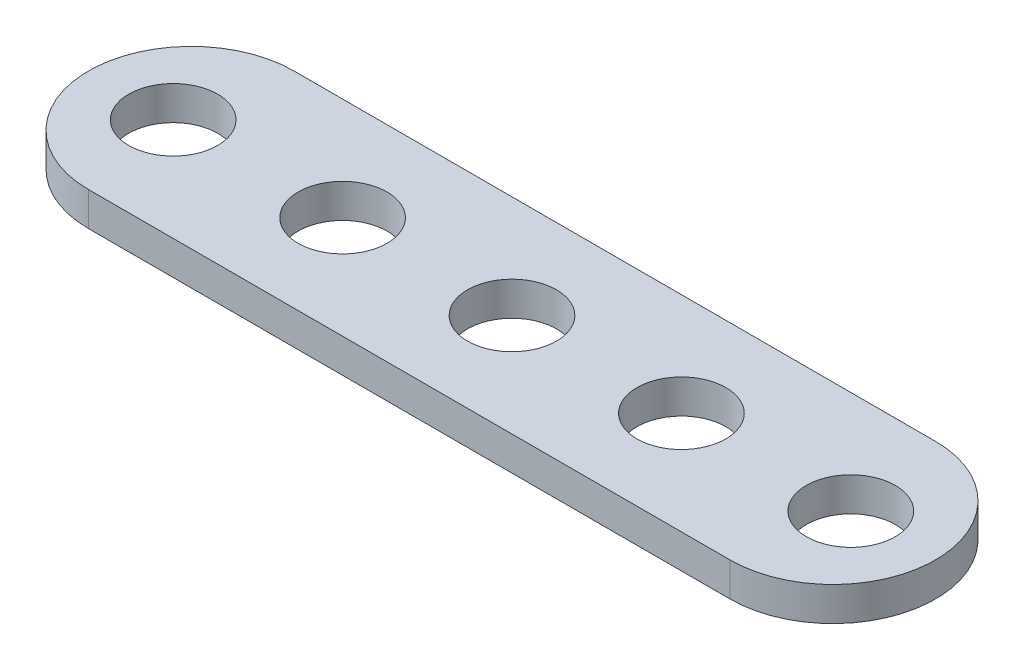
ISO-10303-21;
HEADER;
FILE_DESCRIPTION(('STEP AP214'),'2;1');
FILE_NAME('part.step','',(''),(''),'','','');
FILE_SCHEMA(('AUTOMOTIVE_DESIGN { 1 0 10303 214 1 1 1 1 }'));
ENDSEC;
DATA;
#1=APPLICATION_CONTEXT('core data for automotive mechanical design processes');
#2=APPLICATION_PROTOCOL_DEFINITION('international standard','automotive_design',2000,#1);
#3=PRODUCT_CONTEXT('',#1,'mechanical');
#4=PRODUCT('Part','Part','',(#3));
#5=PRODUCT_RELATED_PRODUCT_CATEGORY('part','',(#4));
#6=PRODUCT_DEFINITION_FORMATION('','',#4);
#7=PRODUCT_DEFINITION_CONTEXT('part definition',#1,'design');
#8=PRODUCT_DEFINITION('design','',#6,#7);
#9=PRODUCT_DEFINITION_SHAPE('','',#8);
#10=(LENGTH_UNIT() NAMED_UNIT(*) SI_UNIT(.MILLI.,.METRE.));
#11=(NAMED_UNIT(*) PLANE_ANGLE_UNIT() SI_UNIT($,.RADIAN.));
#12=(NAMED_UNIT(*) SI_UNIT($,.STERADIAN.) SOLID_ANGLE_UNIT());
#13=UNCERTAINTY_MEASURE_WITH_UNIT(LENGTH_MEASURE(1.E-05),#10,'distance_accuracy_value','');
#14=(GEOMETRIC_REPRESENTATION_CONTEXT(3) GLOBAL_UNCERTAINTY_ASSIGNED_CONTEXT((#13)) GLOBAL_UNIT_ASSIGNED_CONTEXT((#10,
#11,#12)) REPRESENTATION_CONTEXT('',''));
#15=CARTESIAN_POINT('',(0.,0.,0.));
#16=DIRECTION('',(0.,0.,1.));
#17=DIRECTION('',(1.,0.,0.));
#18=AXIS2_PLACEMENT_3D('',#15,#16,#17);
#19=CARTESIAN_POINT('',(4.85,1.6,0.));
#20=DIRECTION('',(0.,-1.,0.));
#21=DIRECTION('',(0.,0.,-1.));
#22=AXIS2_PLACEMENT_3D('',#19,#20,#21);
#23=CYLINDRICAL_SURFACE('',#22,4.85);
#24=CARTESIAN_POINT('',(4.85,0.,0.));
#25=DIRECTION('',(0.,1.,0.));
#26=DIRECTION('',(0.,0.,1.));
#27=AXIS2_PLACEMENT_3D('',#24,#25,#26);
#28=CIRCLE('',#27,4.85);
#29=CARTESIAN_POINT('',(4.85,0.,-4.85));
#30=VERTEX_POINT('',#29);
#31=CARTESIAN_POINT('',(4.85,0.,4.85));
#32=VERTEX_POINT('',#31);
#33=EDGE_CURVE('E95',#30,#32,#28,.T.);
#34=ORIENTED_EDGE('',*,*,#33,.T.);
#35=DIRECTION('',(0.,-1.,0.));
#36=VECTOR('',#35,1.);
#37=CARTESIAN_POINT('',(4.85,1.6,4.85));
#38=LINE('',#37,#36);
#39=CARTESIAN_POINT('',(4.85,1.6,4.85));
#40=VERTEX_POINT('',#39);
#41=EDGE_CURVE('E11',#40,#32,#38,.T.);
#42=ORIENTED_EDGE('',*,*,#41,.F.);
#43=CARTESIAN_POINT('',(4.85,1.6,0.));
#44=DIRECTION('',(0.,1.,0.));
#45=DIRECTION('',(0.,0.,1.));
#46=AXIS2_PLACEMENT_3D('',#43,#44,#45);
#47=CIRCLE('',#46,4.85);
#48=CARTESIAN_POINT('',(4.85,1.6,-4.85));
#49=VERTEX_POINT('',#48);
#50=EDGE_CURVE('E83',#49,#40,#47,.T.);
#51=ORIENTED_EDGE('',*,*,#50,.F.);
#52=DIRECTION('',(0.,-1.,0.));
#53=VECTOR('',#52,1.);
#54=CARTESIAN_POINT('',(4.85,1.6,-4.85));
#55=LINE('',#54,#53);
#56=EDGE_CURVE('E91',#49,#30,#55,.T.);
#57=ORIENTED_EDGE('',*,*,#56,.T.);
#58=EDGE_LOOP('',(#34,#42,#51,#57));
#59=FACE_BOUND('',#58,.T.);
#60=ADVANCED_FACE('F32',(#59),#23,.T.);
#61=CARTESIAN_POINT('',(4.85,1.6,4.85));
#62=DIRECTION('',(0.,0.,-1.));
#63=DIRECTION('',(-1.,0.,0.));
#64=AXIS2_PLACEMENT_3D('',#61,#62,#63);
#65=PLANE('',#64);
#66=DIRECTION('',(1.,0.,0.));
#67=VECTOR('',#66,1.);
#68=CARTESIAN_POINT('',(4.85,0.,4.85));
#69=LINE('',#68,#67);
#70=CARTESIAN_POINT('',(35.15,0.,4.85));
#71=VERTEX_POINT('',#70);
#72=EDGE_CURVE('E87',#32,#71,#69,.T.);
#73=ORIENTED_EDGE('',*,*,#72,.T.);
#74=DIRECTION('',(0.,-1.,0.));
#75=VECTOR('',#74,1.);
#76=CARTESIAN_POINT('',(35.15,1.6,4.85));
#77=LINE('',#76,#75);
#78=CARTESIAN_POINT('',(35.15,1.6,4.85));
#79=VERTEX_POINT('',#78);
#80=EDGE_CURVE('E40',#79,#71,#77,.T.);
#81=ORIENTED_EDGE('',*,*,#80,.F.);
#82=DIRECTION('',(1.,0.,0.));
#83=VECTOR('',#82,1.);
#84=CARTESIAN_POINT('',(4.85,1.6,4.85));
#85=LINE('',#84,#83);
#86=EDGE_CURVE('E78',#40,#79,#85,.T.);
#87=ORIENTED_EDGE('',*,*,#86,.F.);
#88=ORIENTED_EDGE('',*,*,#41,.T.);
#89=EDGE_LOOP('',(#73,#81,#87,#88));
#90=FACE_BOUND('',#89,.T.);
#91=ADVANCED_FACE('F86',(#90),#65,.F.);
#92=CARTESIAN_POINT('',(35.15,1.6,0.));
#93=DIRECTION('',(0.,-1.,0.));
#94=DIRECTION('',(0.,0.,-1.));
#95=AXIS2_PLACEMENT_3D('',#92,#93,#94);
#96=CYLINDRICAL_SURFACE('',#95,4.85);
#97=CARTESIAN_POINT('',(35.15,0.,0.));
#98=DIRECTION('',(0.,1.,0.));
#99=DIRECTION('',(0.,0.,1.));
#100=AXIS2_PLACEMENT_3D('',#97,#98,#99);
#101=CIRCLE('',#100,4.85);
#102=CARTESIAN_POINT('',(35.15,0.,-4.85));
#103=VERTEX_POINT('',#102);
#104=EDGE_CURVE('E65',#71,#103,#101,.T.);
#105=ORIENTED_EDGE('',*,*,#104,.T.);
#106=DIRECTION('',(0.,-1.,0.));
#107=VECTOR('',#106,1.);
#108=CARTESIAN_POINT('',(35.15,1.6,-4.85));
#109=LINE('',#108,#107);
#110=CARTESIAN_POINT('',(35.15,1.6,-4.85));
#111=VERTEX_POINT('',#110);
#112=EDGE_CURVE('E88',#111,#103,#109,.T.);
#113=ORIENTED_EDGE('',*,*,#112,.F.);
#114=CARTESIAN_POINT('',(35.15,1.6,0.));
#115=DIRECTION('',(0.,1.,0.));
#116=DIRECTION('',(0.,0.,1.));
#117=AXIS2_PLACEMENT_3D('',#114,#115,#116);
#118=CIRCLE('',#117,4.85);
#119=EDGE_CURVE('E81',#79,#111,#118,.T.);
#120=ORIENTED_EDGE('',*,*,#119,.F.);
#121=ORIENTED_EDGE('',*,*,#80,.T.);
#122=EDGE_LOOP('',(#105,#113,#120,#121));
#123=FACE_BOUND('',#122,.T.);
#124=ADVANCED_FACE('F89',(#123),#96,.T.);
#125=CARTESIAN_POINT('',(4.85,1.6,-4.85));
#126=DIRECTION('',(0.,0.,1.));
#127=DIRECTION('',(1.,0.,0.));
#128=AXIS2_PLACEMENT_3D('',#125,#126,#127);
#129=PLANE('',#128);
#130=DIRECTION('',(-1.,0.,0.));
#131=VECTOR('',#130,1.);
#132=CARTESIAN_POINT('',(4.85,0.,-4.85));
#133=LINE('',#132,#131);
#134=EDGE_CURVE('E71',#103,#30,#133,.T.);
#135=ORIENTED_EDGE('',*,*,#134,.T.);
#136=ORIENTED_EDGE('',*,*,#56,.F.);
#137=DIRECTION('',(-1.,0.,0.));
#138=VECTOR('',#137,1.);
#139=CARTESIAN_POINT('',(4.85,1.6,-4.85));
#140=LINE('',#139,#138);
#141=EDGE_CURVE('E48',#111,#49,#140,.T.);
#142=ORIENTED_EDGE('',*,*,#141,.F.);
#143=ORIENTED_EDGE('',*,*,#112,.T.);
#144=EDGE_LOOP('',(#135,#136,#142,#143));
#145=FACE_BOUND('',#144,.T.);
#146=ADVANCED_FACE('F103',(#145),#129,.F.);
#147=CARTESIAN_POINT('',(4.85,1.6,0.));
#148=DIRECTION('',(0.,1.,0.));
#149=DIRECTION('',(0.,0.,1.));
#150=AXIS2_PLACEMENT_3D('',#147,#148,#149);
#151=PLANE('',#150);
#152=CARTESIAN_POINT('',(36.,1.6,0.));
#153=DIRECTION('',(0.,1.,0.));
#154=DIRECTION('',(0.,0.,1.));
#155=AXIS2_PLACEMENT_3D('',#152,#153,#154);
#156=CIRCLE('',#155,2.1);
#157=CARTESIAN_POINT('',(36.,1.6,2.1));
#158=VERTEX_POINT('',#157);
#159=EDGE_CURVE('E133',#158,#158,#156,.T.);
#160=ORIENTED_EDGE('',*,*,#159,.F.);
#161=EDGE_LOOP('',(#160));
#162=FACE_BOUND('',#161,.T.);
#163=CARTESIAN_POINT('',(28.,1.6,0.));
#164=DIRECTION('',(0.,1.,0.));
#165=DIRECTION('',(0.,0.,1.));
#166=AXIS2_PLACEMENT_3D('',#163,#164,#165);
#167=CIRCLE('',#166,2.1);
#168=CARTESIAN_POINT('',(28.,1.6,2.1));
#169=VERTEX_POINT('',#168);
#170=EDGE_CURVE('E127',#169,#169,#167,.T.);
#171=ORIENTED_EDGE('',*,*,#170,.F.);
#172=EDGE_LOOP('',(#171));
#173=FACE_BOUND('',#172,.T.);
#174=CARTESIAN_POINT('',(20.,1.6,0.));
#175=DIRECTION('',(0.,1.,0.));
#176=DIRECTION('',(0.,0.,1.));
#177=AXIS2_PLACEMENT_3D('',#174,#175,#176);
#178=CIRCLE('',#177,2.1);
#179=CARTESIAN_POINT('',(20.,1.6,2.1));
#180=VERTEX_POINT('',#179);
#181=EDGE_CURVE('E121',#180,#180,#178,.T.);
#182=ORIENTED_EDGE('',*,*,#181,.F.);
#183=EDGE_LOOP('',(#182));
#184=FACE_BOUND('',#183,.T.);
#185=CARTESIAN_POINT('',(12.,1.6,0.));
#186=DIRECTION('',(0.,1.,0.));
#187=DIRECTION('',(0.,0.,1.));
#188=AXIS2_PLACEMENT_3D('',#185,#186,#187);
#189=CIRCLE('',#188,2.1);
#190=CARTESIAN_POINT('',(12.,1.6,2.1));
#191=VERTEX_POINT('',#190);
#192=EDGE_CURVE('E115',#191,#191,#189,.T.);
#193=ORIENTED_EDGE('',*,*,#192,.F.);
#194=EDGE_LOOP('',(#193));
#195=FACE_BOUND('',#194,.T.);
#196=CARTESIAN_POINT('',(4.,1.6,0.));
#197=DIRECTION('',(0.,1.,0.));
#198=DIRECTION('',(0.,0.,1.));
#199=AXIS2_PLACEMENT_3D('',#196,#197,#198);
#200=CIRCLE('',#199,2.1);
#201=CARTESIAN_POINT('',(4.,1.6,2.1));
#202=VERTEX_POINT('',#201);
#203=EDGE_CURVE('E109',#202,#202,#200,.T.);
#204=ORIENTED_EDGE('',*,*,#203,.F.);
#205=EDGE_LOOP('',(#204));
#206=FACE_BOUND('',#205,.T.);
#207=ORIENTED_EDGE('',*,*,#50,.T.);
#208=ORIENTED_EDGE('',*,*,#86,.T.);
#209=ORIENTED_EDGE('',*,*,#119,.T.);
#210=ORIENTED_EDGE('',*,*,#141,.T.);
#211=EDGE_LOOP('',(#207,#208,#209,#210));
#212=FACE_BOUND('',#211,.T.);
#213=ADVANCED_FACE('F79',(#162,#173,#184,#195,#206,#212),#151,.T.);
#214=CARTESIAN_POINT('',(4.85,0.,0.));
#215=DIRECTION('',(0.,1.,0.));
#216=DIRECTION('',(0.,0.,1.));
#217=AXIS2_PLACEMENT_3D('',#214,#215,#216);
#218=PLANE('',#217);
#219=CARTESIAN_POINT('',(36.,0.,0.));
#220=DIRECTION('',(0.,1.,0.));
#221=DIRECTION('',(0.,0.,1.));
#222=AXIS2_PLACEMENT_3D('',#219,#220,#221);
#223=CIRCLE('',#222,2.1);
#224=CARTESIAN_POINT('',(36.,0.,2.1));
#225=VERTEX_POINT('',#224);
#226=EDGE_CURVE('E130',#225,#225,#223,.T.);
#227=ORIENTED_EDGE('',*,*,#226,.T.);
#228=EDGE_LOOP('',(#227));
#229=FACE_BOUND('',#228,.T.);
#230=CARTESIAN_POINT('',(28.,0.,0.));
#231=DIRECTION('',(0.,1.,0.));
#232=DIRECTION('',(0.,0.,1.));
#233=AXIS2_PLACEMENT_3D('',#230,#231,#232);
#234=CIRCLE('',#233,2.1);
#235=CARTESIAN_POINT('',(28.,0.,2.1));
#236=VERTEX_POINT('',#235);
#237=EDGE_CURVE('E124',#236,#236,#234,.T.);
#238=ORIENTED_EDGE('',*,*,#237,.T.);
#239=EDGE_LOOP('',(#238));
#240=FACE_BOUND('',#239,.T.);
#241=CARTESIAN_POINT('',(20.,0.,0.));
#242=DIRECTION('',(0.,1.,0.));
#243=DIRECTION('',(0.,0.,1.));
#244=AXIS2_PLACEMENT_3D('',#241,#242,#243);
#245=CIRCLE('',#244,2.1);
#246=CARTESIAN_POINT('',(20.,0.,2.1));
#247=VERTEX_POINT('',#246);
#248=EDGE_CURVE('E118',#247,#247,#245,.T.);
#249=ORIENTED_EDGE('',*,*,#248,.T.);
#250=EDGE_LOOP('',(#249));
#251=FACE_BOUND('',#250,.T.);
#252=CARTESIAN_POINT('',(12.,0.,0.));
#253=DIRECTION('',(0.,1.,0.));
#254=DIRECTION('',(0.,0.,1.));
#255=AXIS2_PLACEMENT_3D('',#252,#253,#254);
#256=CIRCLE('',#255,2.1);
#257=CARTESIAN_POINT('',(12.,0.,2.1));
#258=VERTEX_POINT('',#257);
#259=EDGE_CURVE('E112',#258,#258,#256,.T.);
#260=ORIENTED_EDGE('',*,*,#259,.T.);
#261=EDGE_LOOP('',(#260));
#262=FACE_BOUND('',#261,.T.);
#263=CARTESIAN_POINT('',(4.,0.,0.));
#264=DIRECTION('',(0.,1.,0.));
#265=DIRECTION('',(0.,0.,1.));
#266=AXIS2_PLACEMENT_3D('',#263,#264,#265);
#267=CIRCLE('',#266,2.1);
#268=CARTESIAN_POINT('',(4.,0.,2.1));
#269=VERTEX_POINT('',#268);
#270=EDGE_CURVE('E98',#269,#269,#267,.T.);
#271=ORIENTED_EDGE('',*,*,#270,.T.);
#272=EDGE_LOOP('',(#271));
#273=FACE_BOUND('',#272,.T.);
#274=ORIENTED_EDGE('',*,*,#33,.F.);
#275=ORIENTED_EDGE('',*,*,#134,.F.);
#276=ORIENTED_EDGE('',*,*,#104,.F.);
#277=ORIENTED_EDGE('',*,*,#72,.F.);
#278=EDGE_LOOP('',(#274,#275,#276,#277));
#279=FACE_BOUND('',#278,.T.);
#280=ADVANCED_FACE('F106',(#229,#240,#251,#262,#273,#279),#218,.F.);
#281=CARTESIAN_POINT('',(4.,0.,0.));
#282=DIRECTION('',(0.,1.,0.));
#283=DIRECTION('',(0.,0.,1.));
#284=AXIS2_PLACEMENT_3D('',#281,#282,#283);
#285=CYLINDRICAL_SURFACE('',#284,2.1);
#286=ORIENTED_EDGE('',*,*,#270,.F.);
#287=EDGE_LOOP('',(#286));
#288=FACE_BOUND('',#287,.T.);
#289=ORIENTED_EDGE('',*,*,#203,.T.);
#290=EDGE_LOOP('',(#289));
#291=FACE_BOUND('',#290,.T.);
#292=ADVANCED_FACE('F159',(#288,#291),#285,.F.);
#293=CARTESIAN_POINT('',(12.,0.,0.));
#294=DIRECTION('',(0.,1.,0.));
#295=DIRECTION('',(0.,0.,1.));
#296=AXIS2_PLACEMENT_3D('',#293,#294,#295);
#297=CYLINDRICAL_SURFACE('',#296,2.1);
#298=ORIENTED_EDGE('',*,*,#259,.F.);
#299=EDGE_LOOP('',(#298));
#300=FACE_BOUND('',#299,.T.);
#301=ORIENTED_EDGE('',*,*,#192,.T.);
#302=EDGE_LOOP('',(#301));
#303=FACE_BOUND('',#302,.T.);
#304=ADVANCED_FACE('F161',(#300,#303),#297,.F.);
#305=CARTESIAN_POINT('',(20.,0.,0.));
#306=DIRECTION('',(0.,1.,0.));
#307=DIRECTION('',(0.,0.,1.));
#308=AXIS2_PLACEMENT_3D('',#305,#306,#307);
#309=CYLINDRICAL_SURFACE('',#308,2.1);
#310=ORIENTED_EDGE('',*,*,#248,.F.);
#311=EDGE_LOOP('',(#310));
#312=FACE_BOUND('',#311,.T.);
#313=ORIENTED_EDGE('',*,*,#181,.T.);
#314=EDGE_LOOP('',(#313));
#315=FACE_BOUND('',#314,.T.);
#316=ADVANCED_FACE('F168',(#312,#315),#309,.F.);
#317=CARTESIAN_POINT('',(28.,0.,0.));
#318=DIRECTION('',(0.,1.,0.));
#319=DIRECTION('',(0.,0.,1.));
#320=AXIS2_PLACEMENT_3D('',#317,#318,#319);
#321=CYLINDRICAL_SURFACE('',#320,2.1);
#322=ORIENTED_EDGE('',*,*,#237,.F.);
#323=EDGE_LOOP('',(#322));
#324=FACE_BOUND('',#323,.T.);
#325=ORIENTED_EDGE('',*,*,#170,.T.);
#326=EDGE_LOOP('',(#325));
#327=FACE_BOUND('',#326,.T.);
#328=ADVANCED_FACE('F144',(#324,#327),#321,.F.);
#329=CARTESIAN_POINT('',(36.,0.,0.));
#330=DIRECTION('',(0.,1.,0.));
#331=DIRECTION('',(0.,0.,1.));
#332=AXIS2_PLACEMENT_3D('',#329,#330,#331);
#333=CYLINDRICAL_SURFACE('',#332,2.1);
#334=ORIENTED_EDGE('',*,*,#226,.F.);
#335=EDGE_LOOP('',(#334));
#336=FACE_BOUND('',#335,.T.);
#337=ORIENTED_EDGE('',*,*,#159,.T.);
#338=EDGE_LOOP('',(#337));
#339=FACE_BOUND('',#338,.T.);
#340=ADVANCED_FACE('F141',(#336,#339),#333,.F.);
#341=CLOSED_SHELL('',(#60,#91,#124,#146,#213,#280,#292,#304,#316,#328,#340));
#342=MANIFOLD_SOLID_BREP('B2',#341);
#343=ADVANCED_BREP_SHAPE_REPRESENTATION('',(#18,#342),#14);
#344=SHAPE_DEFINITION_REPRESENTATION(#9,#343);
ENDSEC;
END-ISO-10303-21;
